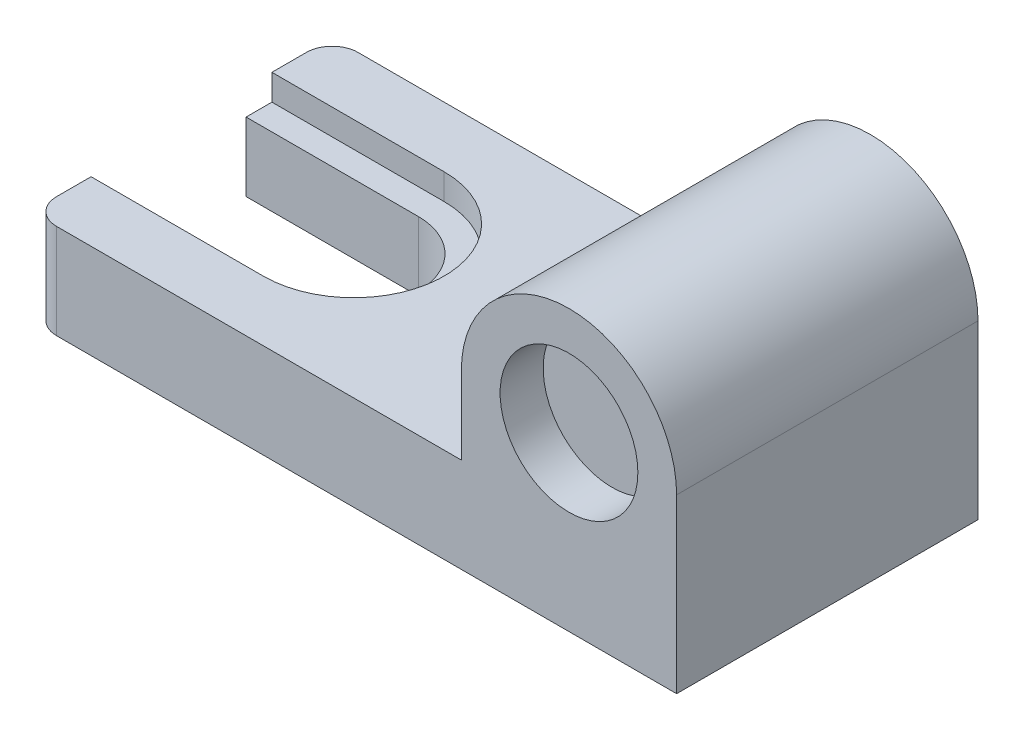
ISO-10303-21;
HEADER;
FILE_DESCRIPTION(('STEP AP214'),'2;1');
FILE_NAME('part.step','',(''),(''),'','','');
FILE_SCHEMA(('AUTOMOTIVE_DESIGN { 1 0 10303 214 1 1 1 1 }'));
ENDSEC;
DATA;
#1=APPLICATION_CONTEXT('core data for automotive mechanical design processes');
#2=APPLICATION_PROTOCOL_DEFINITION('international standard','automotive_design',2000,#1);
#3=PRODUCT_CONTEXT('',#1,'mechanical');
#4=PRODUCT('Part','Part','',(#3));
#5=PRODUCT_RELATED_PRODUCT_CATEGORY('part','',(#4));
#6=PRODUCT_DEFINITION_FORMATION('','',#4);
#7=PRODUCT_DEFINITION_CONTEXT('part definition',#1,'design');
#8=PRODUCT_DEFINITION('design','',#6,#7);
#9=PRODUCT_DEFINITION_SHAPE('','',#8);
#10=(LENGTH_UNIT() NAMED_UNIT(*) SI_UNIT(.MILLI.,.METRE.));
#11=(NAMED_UNIT(*) PLANE_ANGLE_UNIT() SI_UNIT($,.RADIAN.));
#12=(NAMED_UNIT(*) SI_UNIT($,.STERADIAN.) SOLID_ANGLE_UNIT());
#13=UNCERTAINTY_MEASURE_WITH_UNIT(LENGTH_MEASURE(1.E-05),#10,'distance_accuracy_value','');
#14=(GEOMETRIC_REPRESENTATION_CONTEXT(3) GLOBAL_UNCERTAINTY_ASSIGNED_CONTEXT((#13)) GLOBAL_UNIT_ASSIGNED_CONTEXT((#10,
#11,#12)) REPRESENTATION_CONTEXT('',''));
#15=CARTESIAN_POINT('',(0.,0.,0.));
#16=DIRECTION('',(0.,0.,1.));
#17=DIRECTION('',(1.,0.,0.));
#18=AXIS2_PLACEMENT_3D('',#15,#16,#17);
#19=CARTESIAN_POINT('',(75.,0.,35.));
#20=DIRECTION('',(-1.,0.,0.));
#21=DIRECTION('',(0.,0.,1.));
#22=AXIS2_PLACEMENT_3D('',#19,#20,#21);
#23=PLANE('',#22);
#24=DIRECTION('',(0.,0.,1.));
#25=VECTOR('',#24,1.);
#26=CARTESIAN_POINT('',(75.,20.,0.));
#27=LINE('',#26,#25);
#28=CARTESIAN_POINT('',(75.,20.,0.));
#29=VERTEX_POINT('',#28);
#30=CARTESIAN_POINT('',(75.,20.,35.));
#31=VERTEX_POINT('',#30);
#32=EDGE_CURVE('E144',#29,#31,#27,.T.);
#33=ORIENTED_EDGE('',*,*,#32,.T.);
#34=DIRECTION('',(0.,1.,0.));
#35=VECTOR('',#34,1.);
#36=CARTESIAN_POINT('',(75.,0.,35.));
#37=LINE('',#36,#35);
#38=CARTESIAN_POINT('',(75.,0.,35.));
#39=VERTEX_POINT('',#38);
#40=EDGE_CURVE('E169',#39,#31,#37,.T.);
#41=ORIENTED_EDGE('',*,*,#40,.F.);
#42=DIRECTION('',(0.,0.,-1.));
#43=VECTOR('',#42,1.);
#44=CARTESIAN_POINT('',(75.,0.,35.));
#45=LINE('',#44,#43);
#46=CARTESIAN_POINT('',(75.,0.,0.));
#47=VERTEX_POINT('',#46);
#48=EDGE_CURVE('E165',#39,#47,#45,.T.);
#49=ORIENTED_EDGE('',*,*,#48,.T.);
#50=DIRECTION('',(0.,1.,0.));
#51=VECTOR('',#50,1.);
#52=CARTESIAN_POINT('',(75.,0.,0.));
#53=LINE('',#52,#51);
#54=EDGE_CURVE('E159',#47,#29,#53,.T.);
#55=ORIENTED_EDGE('',*,*,#54,.T.);
#56=EDGE_LOOP('',(#33,#41,#49,#55));
#57=FACE_BOUND('',#56,.T.);
#58=ADVANCED_FACE('F33',(#57),#23,.F.);
#59=CARTESIAN_POINT('',(0.,0.,35.));
#60=DIRECTION('',(1.,0.,0.));
#61=DIRECTION('',(0.,0.,-1.));
#62=AXIS2_PLACEMENT_3D('',#59,#60,#61);
#63=PLANE('',#62);
#64=DIRECTION('',(0.,0.,1.));
#65=VECTOR('',#64,1.);
#66=CARTESIAN_POINT('',(0.,11.,0.));
#67=LINE('',#66,#65);
#68=CARTESIAN_POINT('',(0.,11.,3.));
#69=VERTEX_POINT('',#68);
#70=CARTESIAN_POINT('',(0.,11.,7.));
#71=VERTEX_POINT('',#70);
#72=EDGE_CURVE('E225',#69,#71,#67,.T.);
#73=ORIENTED_EDGE('',*,*,#72,.F.);
#74=DIRECTION('',(0.,-1.,0.));
#75=VECTOR('',#74,1.);
#76=CARTESIAN_POINT('',(0.,0.,3.));
#77=LINE('',#76,#75);
#78=CARTESIAN_POINT('',(0.,0.,3.));
#79=VERTEX_POINT('',#78);
#80=EDGE_CURVE('E179',#69,#79,#77,.T.);
#81=ORIENTED_EDGE('',*,*,#80,.T.);
#82=DIRECTION('',(0.,0.,-1.));
#83=VECTOR('',#82,1.);
#84=CARTESIAN_POINT('',(0.,0.,35.));
#85=LINE('',#84,#83);
#86=CARTESIAN_POINT('',(0.,0.,10.));
#87=VERTEX_POINT('',#86);
#88=EDGE_CURVE('E176',#87,#79,#85,.T.);
#89=ORIENTED_EDGE('',*,*,#88,.F.);
#90=DIRECTION('',(0.,1.,0.));
#91=VECTOR('',#90,1.);
#92=CARTESIAN_POINT('',(0.,0.,10.));
#93=LINE('',#92,#91);
#94=CARTESIAN_POINT('',(0.,8.00000000000001,10.));
#95=VERTEX_POINT('',#94);
#96=EDGE_CURVE('E277',#87,#95,#93,.T.);
#97=ORIENTED_EDGE('',*,*,#96,.T.);
#98=DIRECTION('',(0.,0.,1.));
#99=VECTOR('',#98,1.);
#100=CARTESIAN_POINT('',(0.,8.00000000000001,7.));
#101=LINE('',#100,#99);
#102=CARTESIAN_POINT('',(0.,8.00000000000001,7.));
#103=VERTEX_POINT('',#102);
#104=EDGE_CURVE('E244',#103,#95,#101,.T.);
#105=ORIENTED_EDGE('',*,*,#104,.F.);
#106=DIRECTION('',(0.,1.,0.));
#107=VECTOR('',#106,1.);
#108=CARTESIAN_POINT('',(0.,8.00000000000001,7.));
#109=LINE('',#108,#107);
#110=EDGE_CURVE('E241',#103,#71,#109,.T.);
#111=ORIENTED_EDGE('',*,*,#110,.T.);
#112=EDGE_LOOP('',(#73,#81,#89,#97,#105,#111));
#113=FACE_BOUND('',#112,.T.);
#114=ADVANCED_FACE('F238',(#113),#63,.F.);
#115=CARTESIAN_POINT('',(0.,11.,0.));
#116=DIRECTION('',(0.,-1.,0.));
#117=DIRECTION('',(0.,0.,-1.));
#118=AXIS2_PLACEMENT_3D('',#115,#116,#117);
#119=PLANE('',#118);
#120=CARTESIAN_POINT('',(0.,11.,28.));
#121=VERTEX_POINT('',#120);
#122=CARTESIAN_POINT('',(0.,11.,32.));
#123=VERTEX_POINT('',#122);
#124=EDGE_CURVE('E211',#121,#123,#67,.T.);
#125=ORIENTED_EDGE('',*,*,#124,.T.);
#126=CARTESIAN_POINT('',(3.,11.,32.));
#127=DIRECTION('',(0.,-1.,0.));
#128=DIRECTION('',(0.,0.,-1.));
#129=AXIS2_PLACEMENT_3D('',#126,#127,#128);
#130=CIRCLE('',#129,3.);
#131=CARTESIAN_POINT('',(3.,11.,35.));
#132=VERTEX_POINT('',#131);
#133=EDGE_CURVE('E11',#123,#132,#130,.F.);
#134=ORIENTED_EDGE('',*,*,#133,.T.);
#135=DIRECTION('',(1.,0.,0.));
#136=VECTOR('',#135,1.);
#137=CARTESIAN_POINT('',(0.,11.,35.));
#138=LINE('',#137,#136);
#139=CARTESIAN_POINT('',(50.,11.,35.));
#140=VERTEX_POINT('',#139);
#141=EDGE_CURVE('E208',#132,#140,#138,.T.);
#142=ORIENTED_EDGE('',*,*,#141,.T.);
#143=DIRECTION('',(0.,0.,1.));
#144=VECTOR('',#143,1.);
#145=CARTESIAN_POINT('',(50.,11.,0.));
#146=LINE('',#145,#144);
#147=CARTESIAN_POINT('',(50.,11.,0.));
#148=VERTEX_POINT('',#147);
#149=EDGE_CURVE('E171',#148,#140,#146,.T.);
#150=ORIENTED_EDGE('',*,*,#149,.F.);
#151=DIRECTION('',(1.,0.,0.));
#152=VECTOR('',#151,1.);
#153=CARTESIAN_POINT('',(0.,11.,0.));
#154=LINE('',#153,#152);
#155=CARTESIAN_POINT('',(3.,11.,0.));
#156=VERTEX_POINT('',#155);
#157=EDGE_CURVE('E218',#156,#148,#154,.T.);
#158=ORIENTED_EDGE('',*,*,#157,.F.);
#159=CARTESIAN_POINT('',(3.,11.,3.));
#160=DIRECTION('',(0.,-1.,0.));
#161=DIRECTION('',(0.,0.,-1.));
#162=AXIS2_PLACEMENT_3D('',#159,#160,#161);
#163=CIRCLE('',#162,3.);
#164=EDGE_CURVE('E186',#156,#69,#163,.F.);
#165=ORIENTED_EDGE('',*,*,#164,.T.);
#166=ORIENTED_EDGE('',*,*,#72,.T.);
#167=DIRECTION('',(-1.,0.,0.));
#168=VECTOR('',#167,1.);
#169=CARTESIAN_POINT('',(0.,11.,7.));
#170=LINE('',#169,#168);
#171=CARTESIAN_POINT('',(20.,11.,7.));
#172=VERTEX_POINT('',#171);
#173=EDGE_CURVE('E256',#172,#71,#170,.T.);
#174=ORIENTED_EDGE('',*,*,#173,.F.);
#175=CARTESIAN_POINT('',(20.,11.,17.5));
#176=DIRECTION('',(0.,1.,0.));
#177=DIRECTION('',(0.,0.,-1.));
#178=AXIS2_PLACEMENT_3D('',#175,#176,#177);
#179=CIRCLE('',#178,10.5);
#180=CARTESIAN_POINT('',(20.,11.,28.));
#181=VERTEX_POINT('',#180);
#182=EDGE_CURVE('E308',#181,#172,#179,.T.);
#183=ORIENTED_EDGE('',*,*,#182,.F.);
#184=DIRECTION('',(1.,0.,0.));
#185=VECTOR('',#184,1.);
#186=CARTESIAN_POINT('',(0.,11.,28.));
#187=LINE('',#186,#185);
#188=EDGE_CURVE('E279',#121,#181,#187,.T.);
#189=ORIENTED_EDGE('',*,*,#188,.F.);
#190=EDGE_LOOP('',(#125,#134,#142,#150,#158,#165,#166,#174,#183,#189));
#191=FACE_BOUND('',#190,.T.);
#192=ADVANCED_FACE('F206',(#191),#119,.F.);
#193=CARTESIAN_POINT('',(0.,0.,32.));
#194=VERTEX_POINT('',#193);
#195=CARTESIAN_POINT('',(0.,0.,25.));
#196=VERTEX_POINT('',#195);
#197=EDGE_CURVE('E177',#194,#196,#85,.T.);
#198=ORIENTED_EDGE('',*,*,#197,.F.);
#199=DIRECTION('',(0.,-1.,0.));
#200=VECTOR('',#199,1.);
#201=CARTESIAN_POINT('',(0.,0.,32.));
#202=LINE('',#201,#200);
#203=EDGE_CURVE('E41',#194,#123,#202,.F.);
#204=ORIENTED_EDGE('',*,*,#203,.T.);
#205=ORIENTED_EDGE('',*,*,#124,.F.);
#206=DIRECTION('',(0.,1.,0.));
#207=VECTOR('',#206,1.);
#208=CARTESIAN_POINT('',(0.,8.00000000000001,28.));
#209=LINE('',#208,#207);
#210=CARTESIAN_POINT('',(0.,8.00000000000001,28.));
#211=VERTEX_POINT('',#210);
#212=EDGE_CURVE('E260',#211,#121,#209,.T.);
#213=ORIENTED_EDGE('',*,*,#212,.F.);
#214=DIRECTION('',(0.,0.,1.));
#215=VECTOR('',#214,1.);
#216=CARTESIAN_POINT('',(0.,8.00000000000001,28.));
#217=LINE('',#216,#215);
#218=CARTESIAN_POINT('',(0.,8.00000000000001,25.));
#219=VERTEX_POINT('',#218);
#220=EDGE_CURVE('E297',#219,#211,#217,.T.);
#221=ORIENTED_EDGE('',*,*,#220,.F.);
#222=DIRECTION('',(0.,1.,0.));
#223=VECTOR('',#222,1.);
#224=CARTESIAN_POINT('',(0.,0.,25.));
#225=LINE('',#224,#223);
#226=EDGE_CURVE('E202',#196,#219,#225,.T.);
#227=ORIENTED_EDGE('',*,*,#226,.F.);
#228=EDGE_LOOP('',(#198,#204,#205,#213,#221,#227));
#229=FACE_BOUND('',#228,.T.);
#230=ADVANCED_FACE('F200',(#229),#63,.F.);
#231=CARTESIAN_POINT('',(0.,0.,35.));
#232=DIRECTION('',(0.,1.,0.));
#233=DIRECTION('',(0.,0.,1.));
#234=AXIS2_PLACEMENT_3D('',#231,#232,#233);
#235=PLANE('',#234);
#236=DIRECTION('',(1.,0.,0.));
#237=VECTOR('',#236,1.);
#238=CARTESIAN_POINT('',(0.,0.,35.));
#239=LINE('',#238,#237);
#240=CARTESIAN_POINT('',(3.,0.,35.));
#241=VERTEX_POINT('',#240);
#242=EDGE_CURVE('E166',#241,#39,#239,.T.);
#243=ORIENTED_EDGE('',*,*,#242,.F.);
#244=CARTESIAN_POINT('',(3.,0.,32.));
#245=DIRECTION('',(0.,1.,0.));
#246=DIRECTION('',(0.,0.,1.));
#247=AXIS2_PLACEMENT_3D('',#244,#245,#246);
#248=CIRCLE('',#247,3.);
#249=EDGE_CURVE('E191',#241,#194,#248,.F.);
#250=ORIENTED_EDGE('',*,*,#249,.T.);
#251=ORIENTED_EDGE('',*,*,#197,.T.);
#252=DIRECTION('',(1.,0.,0.));
#253=VECTOR('',#252,1.);
#254=CARTESIAN_POINT('',(0.,0.,25.));
#255=LINE('',#254,#253);
#256=CARTESIAN_POINT('',(20.,0.,25.));
#257=VERTEX_POINT('',#256);
#258=EDGE_CURVE('E266',#196,#257,#255,.T.);
#259=ORIENTED_EDGE('',*,*,#258,.T.);
#260=CARTESIAN_POINT('',(20.,0.,17.5));
#261=DIRECTION('',(0.,1.,0.));
#262=DIRECTION('',(0.,0.,-1.));
#263=AXIS2_PLACEMENT_3D('',#260,#261,#262);
#264=CIRCLE('',#263,7.5);
#265=CARTESIAN_POINT('',(20.,0.,10.));
#266=VERTEX_POINT('',#265);
#267=EDGE_CURVE('E268',#257,#266,#264,.T.);
#268=ORIENTED_EDGE('',*,*,#267,.T.);
#269=DIRECTION('',(-1.,0.,0.));
#270=VECTOR('',#269,1.);
#271=CARTESIAN_POINT('',(0.,0.,10.));
#272=LINE('',#271,#270);
#273=EDGE_CURVE('E274',#266,#87,#272,.T.);
#274=ORIENTED_EDGE('',*,*,#273,.T.);
#275=ORIENTED_EDGE('',*,*,#88,.T.);
#276=CARTESIAN_POINT('',(3.,0.,3.));
#277=DIRECTION('',(0.,1.,0.));
#278=DIRECTION('',(0.,0.,1.));
#279=AXIS2_PLACEMENT_3D('',#276,#277,#278);
#280=CIRCLE('',#279,3.);
#281=CARTESIAN_POINT('',(3.,0.,0.));
#282=VERTEX_POINT('',#281);
#283=EDGE_CURVE('E182',#79,#282,#280,.F.);
#284=ORIENTED_EDGE('',*,*,#283,.T.);
#285=DIRECTION('',(1.,0.,0.));
#286=VECTOR('',#285,1.);
#287=CARTESIAN_POINT('',(0.,0.,0.));
#288=LINE('',#287,#286);
#289=EDGE_CURVE('E167',#282,#47,#288,.T.);
#290=ORIENTED_EDGE('',*,*,#289,.T.);
#291=ORIENTED_EDGE('',*,*,#48,.F.);
#292=EDGE_LOOP('',(#243,#250,#251,#259,#268,#274,#275,#284,#290,#291));
#293=FACE_BOUND('',#292,.T.);
#294=ADVANCED_FACE('F194',(#293),#235,.F.);
#295=CARTESIAN_POINT('',(0.,0.,35.));
#296=DIRECTION('',(0.,0.,-1.));
#297=DIRECTION('',(-1.,0.,0.));
#298=AXIS2_PLACEMENT_3D('',#295,#296,#297);
#299=PLANE('',#298);
#300=CARTESIAN_POINT('',(62.5,20.,35.));
#301=DIRECTION('',(0.,0.,1.));
#302=DIRECTION('',(1.,0.,0.));
#303=AXIS2_PLACEMENT_3D('',#300,#301,#302);
#304=CIRCLE('',#303,8.00000000000001);
#305=CARTESIAN_POINT('',(70.5,20.,35.));
#306=VERTEX_POINT('',#305);
#307=EDGE_CURVE('E248',#306,#306,#304,.T.);
#308=ORIENTED_EDGE('',*,*,#307,.F.);
#309=EDGE_LOOP('',(#308));
#310=FACE_BOUND('',#309,.T.);
#311=ORIENTED_EDGE('',*,*,#40,.T.);
#312=CARTESIAN_POINT('',(62.5,20.,35.));
#313=DIRECTION('',(0.,0.,-1.));
#314=DIRECTION('',(1.,0.,0.));
#315=AXIS2_PLACEMENT_3D('',#312,#313,#314);
#316=CIRCLE('',#315,12.5);
#317=CARTESIAN_POINT('',(50.,20.,35.));
#318=VERTEX_POINT('',#317);
#319=EDGE_CURVE('E147',#318,#31,#316,.T.);
#320=ORIENTED_EDGE('',*,*,#319,.F.);
#321=DIRECTION('',(0.,1.,0.));
#322=VECTOR('',#321,1.);
#323=CARTESIAN_POINT('',(50.,36.,35.));
#324=LINE('',#323,#322);
#325=EDGE_CURVE('E216',#140,#318,#324,.T.);
#326=ORIENTED_EDGE('',*,*,#325,.F.);
#327=ORIENTED_EDGE('',*,*,#141,.F.);
#328=DIRECTION('',(0.,-1.,0.));
#329=VECTOR('',#328,1.);
#330=CARTESIAN_POINT('',(3.,0.,35.));
#331=LINE('',#330,#329);
#332=EDGE_CURVE('E188',#132,#241,#331,.T.);
#333=ORIENTED_EDGE('',*,*,#332,.T.);
#334=ORIENTED_EDGE('',*,*,#242,.T.);
#335=EDGE_LOOP('',(#311,#320,#326,#327,#333,#334));
#336=FACE_BOUND('',#335,.T.);
#337=ADVANCED_FACE('F214',(#310,#336),#299,.F.);
#338=CARTESIAN_POINT('',(0.,0.,0.));
#339=DIRECTION('',(0.,0.,-1.));
#340=DIRECTION('',(-1.,0.,0.));
#341=AXIS2_PLACEMENT_3D('',#338,#339,#340);
#342=PLANE('',#341);
#343=CARTESIAN_POINT('',(62.5,20.,0.));
#344=DIRECTION('',(0.,0.,-1.));
#345=DIRECTION('',(1.,0.,0.));
#346=AXIS2_PLACEMENT_3D('',#343,#344,#345);
#347=CIRCLE('',#346,12.5);
#348=CARTESIAN_POINT('',(50.,20.,0.));
#349=VERTEX_POINT('',#348);
#350=EDGE_CURVE('E48',#349,#29,#347,.T.);
#351=ORIENTED_EDGE('',*,*,#350,.T.);
#352=ORIENTED_EDGE('',*,*,#54,.F.);
#353=ORIENTED_EDGE('',*,*,#289,.F.);
#354=DIRECTION('',(0.,-1.,0.));
#355=VECTOR('',#354,1.);
#356=CARTESIAN_POINT('',(3.,11.,0.));
#357=LINE('',#356,#355);
#358=EDGE_CURVE('E184',#282,#156,#357,.F.);
#359=ORIENTED_EDGE('',*,*,#358,.T.);
#360=ORIENTED_EDGE('',*,*,#157,.T.);
#361=DIRECTION('',(0.,1.,0.));
#362=VECTOR('',#361,1.);
#363=CARTESIAN_POINT('',(50.,36.,0.));
#364=LINE('',#363,#362);
#365=EDGE_CURVE('E161',#148,#349,#364,.T.);
#366=ORIENTED_EDGE('',*,*,#365,.T.);
#367=EDGE_LOOP('',(#351,#352,#353,#359,#360,#366));
#368=FACE_BOUND('',#367,.T.);
#369=ADVANCED_FACE('F157',(#368),#342,.T.);
#370=CARTESIAN_POINT('',(50.,36.,0.));
#371=DIRECTION('',(1.,0.,0.));
#372=DIRECTION('',(0.,0.,-1.));
#373=AXIS2_PLACEMENT_3D('',#370,#371,#372);
#374=PLANE('',#373);
#375=ORIENTED_EDGE('',*,*,#325,.T.);
#376=DIRECTION('',(0.,0.,1.));
#377=VECTOR('',#376,1.);
#378=CARTESIAN_POINT('',(50.,20.,0.));
#379=LINE('',#378,#377);
#380=EDGE_CURVE('E152',#349,#318,#379,.T.);
#381=ORIENTED_EDGE('',*,*,#380,.F.);
#382=ORIENTED_EDGE('',*,*,#365,.F.);
#383=ORIENTED_EDGE('',*,*,#149,.T.);
#384=EDGE_LOOP('',(#375,#381,#382,#383));
#385=FACE_BOUND('',#384,.T.);
#386=ADVANCED_FACE('F265',(#385),#374,.F.);
#387=CARTESIAN_POINT('',(62.5,20.,30.));
#388=DIRECTION('',(0.,0.,1.));
#389=DIRECTION('',(1.,0.,0.));
#390=AXIS2_PLACEMENT_3D('',#387,#388,#389);
#391=CYLINDRICAL_SURFACE('',#390,8.00000000000001);
#392=CARTESIAN_POINT('',(62.5,20.,30.));
#393=DIRECTION('',(0.,0.,1.));
#394=DIRECTION('',(1.,0.,0.));
#395=AXIS2_PLACEMENT_3D('',#392,#393,#394);
#396=CIRCLE('',#395,8.00000000000001);
#397=CARTESIAN_POINT('',(70.5,20.,30.));
#398=VERTEX_POINT('',#397);
#399=EDGE_CURVE('E220',#398,#398,#396,.T.);
#400=ORIENTED_EDGE('',*,*,#399,.F.);
#401=EDGE_LOOP('',(#400));
#402=FACE_BOUND('',#401,.T.);
#403=ORIENTED_EDGE('',*,*,#307,.T.);
#404=EDGE_LOOP('',(#403));
#405=FACE_BOUND('',#404,.T.);
#406=ADVANCED_FACE('F406',(#402,#405),#391,.F.);
#407=CARTESIAN_POINT('',(62.5,20.,30.));
#408=DIRECTION('',(0.,0.,1.));
#409=DIRECTION('',(1.,0.,0.));
#410=AXIS2_PLACEMENT_3D('',#407,#408,#409);
#411=PLANE('',#410);
#412=ORIENTED_EDGE('',*,*,#399,.T.);
#413=EDGE_LOOP('',(#412));
#414=FACE_BOUND('',#413,.T.);
#415=ADVANCED_FACE('F334',(#414),#411,.T.);
#416=CARTESIAN_POINT('',(0.,8.00000000000001,7.));
#417=DIRECTION('',(0.,0.,-1.));
#418=DIRECTION('',(-1.,0.,0.));
#419=AXIS2_PLACEMENT_3D('',#416,#417,#418);
#420=PLANE('',#419);
#421=ORIENTED_EDGE('',*,*,#173,.T.);
#422=ORIENTED_EDGE('',*,*,#110,.F.);
#423=DIRECTION('',(-1.,0.,0.));
#424=VECTOR('',#423,1.);
#425=CARTESIAN_POINT('',(0.,8.00000000000001,7.));
#426=LINE('',#425,#424);
#427=CARTESIAN_POINT('',(20.,8.00000000000001,7.));
#428=VERTEX_POINT('',#427);
#429=EDGE_CURVE('E262',#428,#103,#426,.T.);
#430=ORIENTED_EDGE('',*,*,#429,.F.);
#431=DIRECTION('',(0.,1.,0.));
#432=VECTOR('',#431,1.);
#433=CARTESIAN_POINT('',(20.,8.00000000000001,7.));
#434=LINE('',#433,#432);
#435=EDGE_CURVE('E249',#428,#172,#434,.T.);
#436=ORIENTED_EDGE('',*,*,#435,.T.);
#437=EDGE_LOOP('',(#421,#422,#430,#436));
#438=FACE_BOUND('',#437,.T.);
#439=ADVANCED_FACE('F312',(#438),#420,.F.);
#440=CARTESIAN_POINT('',(20.,8.00000000000001,17.5));
#441=DIRECTION('',(0.,1.,0.));
#442=DIRECTION('',(0.,0.,1.));
#443=AXIS2_PLACEMENT_3D('',#440,#441,#442);
#444=CYLINDRICAL_SURFACE('',#443,10.5);
#445=ORIENTED_EDGE('',*,*,#182,.T.);
#446=ORIENTED_EDGE('',*,*,#435,.F.);
#447=CARTESIAN_POINT('',(20.,8.00000000000001,17.5));
#448=DIRECTION('',(0.,1.,0.));
#449=DIRECTION('',(0.,0.,-1.));
#450=AXIS2_PLACEMENT_3D('',#447,#448,#449);
#451=CIRCLE('',#450,10.5);
#452=CARTESIAN_POINT('',(20.,8.00000000000001,28.));
#453=VERTEX_POINT('',#452);
#454=EDGE_CURVE('E303',#453,#428,#451,.T.);
#455=ORIENTED_EDGE('',*,*,#454,.F.);
#456=DIRECTION('',(0.,1.,0.));
#457=VECTOR('',#456,1.);
#458=CARTESIAN_POINT('',(20.,8.00000000000001,28.));
#459=LINE('',#458,#457);
#460=EDGE_CURVE('E253',#453,#181,#459,.T.);
#461=ORIENTED_EDGE('',*,*,#460,.T.);
#462=EDGE_LOOP('',(#445,#446,#455,#461));
#463=FACE_BOUND('',#462,.T.);
#464=ADVANCED_FACE('F326',(#463),#444,.F.);
#465=CARTESIAN_POINT('',(0.,8.00000000000001,28.));
#466=DIRECTION('',(0.,0.,1.));
#467=DIRECTION('',(1.,0.,0.));
#468=AXIS2_PLACEMENT_3D('',#465,#466,#467);
#469=PLANE('',#468);
#470=ORIENTED_EDGE('',*,*,#188,.T.);
#471=ORIENTED_EDGE('',*,*,#460,.F.);
#472=DIRECTION('',(1.,0.,0.));
#473=VECTOR('',#472,1.);
#474=CARTESIAN_POINT('',(0.,8.00000000000001,28.));
#475=LINE('',#474,#473);
#476=EDGE_CURVE('E300',#211,#453,#475,.T.);
#477=ORIENTED_EDGE('',*,*,#476,.F.);
#478=ORIENTED_EDGE('',*,*,#212,.T.);
#479=EDGE_LOOP('',(#470,#471,#477,#478));
#480=FACE_BOUND('',#479,.T.);
#481=ADVANCED_FACE('F315',(#480),#469,.F.);
#482=CARTESIAN_POINT('',(20.,8.00000000000001,17.5));
#483=DIRECTION('',(0.,1.,0.));
#484=DIRECTION('',(0.,0.,1.));
#485=AXIS2_PLACEMENT_3D('',#482,#483,#484);
#486=PLANE('',#485);
#487=ORIENTED_EDGE('',*,*,#104,.T.);
#488=DIRECTION('',(1.,0.,0.));
#489=VECTOR('',#488,1.);
#490=CARTESIAN_POINT('',(0.,8.00000000000001,10.));
#491=LINE('',#490,#489);
#492=CARTESIAN_POINT('',(20.,8.00000000000001,10.));
#493=VERTEX_POINT('',#492);
#494=EDGE_CURVE('E288',#95,#493,#491,.T.);
#495=ORIENTED_EDGE('',*,*,#494,.T.);
#496=CARTESIAN_POINT('',(20.,8.00000000000001,17.5));
#497=DIRECTION('',(0.,-1.,0.));
#498=DIRECTION('',(0.,0.,1.));
#499=AXIS2_PLACEMENT_3D('',#496,#497,#498);
#500=CIRCLE('',#499,7.5);
#501=CARTESIAN_POINT('',(20.,8.00000000000001,25.));
#502=VERTEX_POINT('',#501);
#503=EDGE_CURVE('E291',#493,#502,#500,.T.);
#504=ORIENTED_EDGE('',*,*,#503,.T.);
#505=DIRECTION('',(-1.,0.,0.));
#506=VECTOR('',#505,1.);
#507=CARTESIAN_POINT('',(0.,8.00000000000001,25.));
#508=LINE('',#507,#506);
#509=EDGE_CURVE('E294',#502,#219,#508,.T.);
#510=ORIENTED_EDGE('',*,*,#509,.T.);
#511=ORIENTED_EDGE('',*,*,#220,.T.);
#512=ORIENTED_EDGE('',*,*,#476,.T.);
#513=ORIENTED_EDGE('',*,*,#454,.T.);
#514=ORIENTED_EDGE('',*,*,#429,.T.);
#515=EDGE_LOOP('',(#487,#495,#504,#510,#511,#512,#513,#514));
#516=FACE_BOUND('',#515,.T.);
#517=ADVANCED_FACE('F318',(#516),#486,.T.);
#518=CARTESIAN_POINT('',(0.,0.,10.));
#519=DIRECTION('',(0.,0.,-1.));
#520=DIRECTION('',(-1.,0.,0.));
#521=AXIS2_PLACEMENT_3D('',#518,#519,#520);
#522=PLANE('',#521);
#523=ORIENTED_EDGE('',*,*,#494,.F.);
#524=ORIENTED_EDGE('',*,*,#96,.F.);
#525=ORIENTED_EDGE('',*,*,#273,.F.);
#526=DIRECTION('',(0.,1.,0.));
#527=VECTOR('',#526,1.);
#528=CARTESIAN_POINT('',(20.,0.,10.));
#529=LINE('',#528,#527);
#530=EDGE_CURVE('E280',#266,#493,#529,.T.);
#531=ORIENTED_EDGE('',*,*,#530,.T.);
#532=EDGE_LOOP('',(#523,#524,#525,#531));
#533=FACE_BOUND('',#532,.T.);
#534=ADVANCED_FACE('F356',(#533),#522,.F.);
#535=CARTESIAN_POINT('',(20.,0.,17.5));
#536=DIRECTION('',(0.,1.,0.));
#537=DIRECTION('',(0.,0.,1.));
#538=AXIS2_PLACEMENT_3D('',#535,#536,#537);
#539=CYLINDRICAL_SURFACE('',#538,7.5);
#540=ORIENTED_EDGE('',*,*,#503,.F.);
#541=ORIENTED_EDGE('',*,*,#530,.F.);
#542=ORIENTED_EDGE('',*,*,#267,.F.);
#543=DIRECTION('',(0.,1.,0.));
#544=VECTOR('',#543,1.);
#545=CARTESIAN_POINT('',(20.,0.,25.));
#546=LINE('',#545,#544);
#547=EDGE_CURVE('E283',#257,#502,#546,.T.);
#548=ORIENTED_EDGE('',*,*,#547,.T.);
#549=EDGE_LOOP('',(#540,#541,#542,#548));
#550=FACE_BOUND('',#549,.T.);
#551=ADVANCED_FACE('F323',(#550),#539,.F.);
#552=CARTESIAN_POINT('',(0.,0.,25.));
#553=DIRECTION('',(0.,0.,1.));
#554=DIRECTION('',(1.,0.,0.));
#555=AXIS2_PLACEMENT_3D('',#552,#553,#554);
#556=PLANE('',#555);
#557=ORIENTED_EDGE('',*,*,#509,.F.);
#558=ORIENTED_EDGE('',*,*,#547,.F.);
#559=ORIENTED_EDGE('',*,*,#258,.F.);
#560=ORIENTED_EDGE('',*,*,#226,.T.);
#561=EDGE_LOOP('',(#557,#558,#559,#560));
#562=FACE_BOUND('',#561,.T.);
#563=ADVANCED_FACE('F320',(#562),#556,.F.);
#564=CARTESIAN_POINT('',(3.,0.,3.));
#565=DIRECTION('',(0.,1.,0.));
#566=DIRECTION('',(0.,0.,1.));
#567=AXIS2_PLACEMENT_3D('',#564,#565,#566);
#568=CYLINDRICAL_SURFACE('',#567,3.);
#569=ORIENTED_EDGE('',*,*,#164,.F.);
#570=ORIENTED_EDGE('',*,*,#358,.F.);
#571=ORIENTED_EDGE('',*,*,#283,.F.);
#572=ORIENTED_EDGE('',*,*,#80,.F.);
#573=EDGE_LOOP('',(#569,#570,#571,#572));
#574=FACE_BOUND('',#573,.T.);
#575=ADVANCED_FACE('F231',(#574),#568,.T.);
#576=CARTESIAN_POINT('',(3.,0.,32.));
#577=DIRECTION('',(0.,-1.,0.));
#578=DIRECTION('',(0.,0.,-1.));
#579=AXIS2_PLACEMENT_3D('',#576,#577,#578);
#580=CYLINDRICAL_SURFACE('',#579,3.);
#581=ORIENTED_EDGE('',*,*,#133,.F.);
#582=ORIENTED_EDGE('',*,*,#203,.F.);
#583=ORIENTED_EDGE('',*,*,#249,.F.);
#584=ORIENTED_EDGE('',*,*,#332,.F.);
#585=EDGE_LOOP('',(#581,#582,#583,#584));
#586=FACE_BOUND('',#585,.T.);
#587=ADVANCED_FACE('F35',(#586),#580,.T.);
#588=CARTESIAN_POINT('',(62.5,20.,0.));
#589=DIRECTION('',(0.,0.,1.));
#590=DIRECTION('',(1.,0.,0.));
#591=AXIS2_PLACEMENT_3D('',#588,#589,#590);
#592=CYLINDRICAL_SURFACE('',#591,12.5);
#593=ORIENTED_EDGE('',*,*,#319,.T.);
#594=ORIENTED_EDGE('',*,*,#32,.F.);
#595=ORIENTED_EDGE('',*,*,#350,.F.);
#596=ORIENTED_EDGE('',*,*,#380,.T.);
#597=EDGE_LOOP('',(#593,#594,#595,#596));
#598=FACE_BOUND('',#597,.T.);
#599=ADVANCED_FACE('F145',(#598),#592,.T.);
#600=CLOSED_SHELL('',(#58,#114,#192,#230,#294,#337,#369,#386,#406,#415,#439,#464,#481,#517,#534,
#551,#563,#575,#587,#599));
#601=MANIFOLD_SOLID_BREP('B2',#600);
#602=ADVANCED_BREP_SHAPE_REPRESENTATION('',(#18,#601),#14);
#603=SHAPE_DEFINITION_REPRESENTATION(#9,#602);
ENDSEC;
END-ISO-10303-21;
